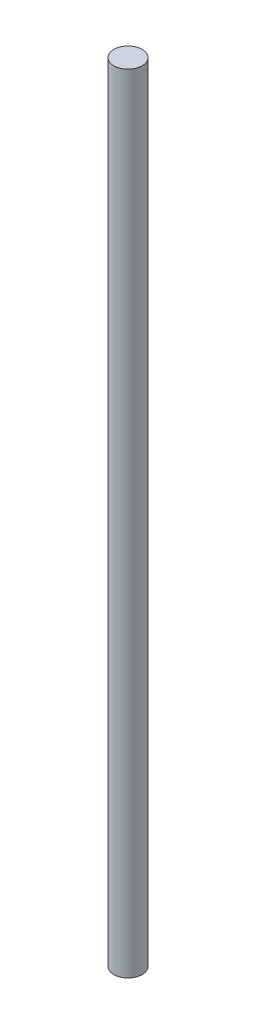
ISO-10303-21;
HEADER;
FILE_DESCRIPTION(('STEP AP214'),'2;1');
FILE_NAME('part.step','',(''),(''),'','','');
FILE_SCHEMA(('AUTOMOTIVE_DESIGN { 1 0 10303 214 1 1 1 1 }'));
ENDSEC;
DATA;
#1=APPLICATION_CONTEXT('core data for automotive mechanical design processes');
#2=APPLICATION_PROTOCOL_DEFINITION('international standard','automotive_design',2000,#1);
#3=PRODUCT_CONTEXT('',#1,'mechanical');
#4=PRODUCT('Part','Part','',(#3));
#5=PRODUCT_RELATED_PRODUCT_CATEGORY('part','',(#4));
#6=PRODUCT_DEFINITION_FORMATION('','',#4);
#7=PRODUCT_DEFINITION_CONTEXT('part definition',#1,'design');
#8=PRODUCT_DEFINITION('design','',#6,#7);
#9=PRODUCT_DEFINITION_SHAPE('','',#8);
#10=(LENGTH_UNIT() NAMED_UNIT(*) SI_UNIT(.MILLI.,.METRE.));
#11=(NAMED_UNIT(*) PLANE_ANGLE_UNIT() SI_UNIT($,.RADIAN.));
#12=(NAMED_UNIT(*) SI_UNIT($,.STERADIAN.) SOLID_ANGLE_UNIT());
#13=UNCERTAINTY_MEASURE_WITH_UNIT(LENGTH_MEASURE(1.E-05),#10,'distance_accuracy_value','');
#14=(GEOMETRIC_REPRESENTATION_CONTEXT(3) GLOBAL_UNCERTAINTY_ASSIGNED_CONTEXT((#13)) GLOBAL_UNIT_ASSIGNED_CONTEXT((#10,
#11,#12)) REPRESENTATION_CONTEXT('',''));
#15=CARTESIAN_POINT('',(0.,0.,0.));
#16=DIRECTION('',(0.,0.,1.));
#17=DIRECTION('',(1.,0.,0.));
#18=AXIS2_PLACEMENT_3D('',#15,#16,#17);
#19=CARTESIAN_POINT('',(0.,264.,0.));
#20=DIRECTION('',(0.,1.,0.));
#21=DIRECTION('',(-1.,0.,0.));
#22=AXIS2_PLACEMENT_3D('',#19,#20,#21);
#23=PLANE('',#22);
#24=CARTESIAN_POINT('',(4.7625,264.,0.));
#25=DIRECTION('',(0.,1.,0.));
#26=DIRECTION('',(-1.,0.,0.));
#27=AXIS2_PLACEMENT_3D('',#24,#25,#26);
#28=CIRCLE('',#27,4.7625);
#29=CARTESIAN_POINT('',(0.,264.,0.));
#30=VERTEX_POINT('',#29);
#31=EDGE_CURVE('E10',#30,#30,#28,.T.);
#32=ORIENTED_EDGE('',*,*,#31,.T.);
#33=EDGE_LOOP('',(#32));
#34=FACE_BOUND('',#33,.T.);
#35=ADVANCED_FACE('F36',(#34),#23,.T.);
#36=CARTESIAN_POINT('',(4.7625,264.,0.));
#37=DIRECTION('',(0.,1.,0.));
#38=DIRECTION('',(-1.,0.,0.));
#39=AXIS2_PLACEMENT_3D('',#36,#37,#38);
#40=CYLINDRICAL_SURFACE('',#39,4.76250000000002);
#41=CARTESIAN_POINT('',(4.76250000000003,0.,0.));
#42=DIRECTION('',(0.,1.,0.));
#43=DIRECTION('',(-1.,0.,0.));
#44=AXIS2_PLACEMENT_3D('',#41,#42,#43);
#45=CIRCLE('',#44,4.76250000000003);
#46=CARTESIAN_POINT('',(0.,0.,0.));
#47=VERTEX_POINT('',#46);
#48=EDGE_CURVE('E42',#47,#47,#45,.T.);
#49=ORIENTED_EDGE('',*,*,#48,.T.);
#50=EDGE_LOOP('',(#49));
#51=FACE_BOUND('',#50,.T.);
#52=ORIENTED_EDGE('',*,*,#31,.F.);
#53=EDGE_LOOP('',(#52));
#54=FACE_BOUND('',#53,.T.);
#55=ADVANCED_FACE('F48',(#51,#54),#40,.T.);
#56=CARTESIAN_POINT('',(0.,0.,0.));
#57=DIRECTION('',(0.,-1.,0.));
#58=DIRECTION('',(1.,0.,0.));
#59=AXIS2_PLACEMENT_3D('',#56,#57,#58);
#60=PLANE('',#59);
#61=ORIENTED_EDGE('',*,*,#48,.F.);
#62=EDGE_LOOP('',(#61));
#63=FACE_BOUND('',#62,.T.);
#64=ADVANCED_FACE('F51',(#63),#60,.T.);
#65=CLOSED_SHELL('',(#35,#55,#64));
#66=MANIFOLD_SOLID_BREP('B2',#65);
#67=ADVANCED_BREP_SHAPE_REPRESENTATION('',(#18,#66),#14);
#68=SHAPE_DEFINITION_REPRESENTATION(#9,#67);
ENDSEC;
END-ISO-10303-21;
